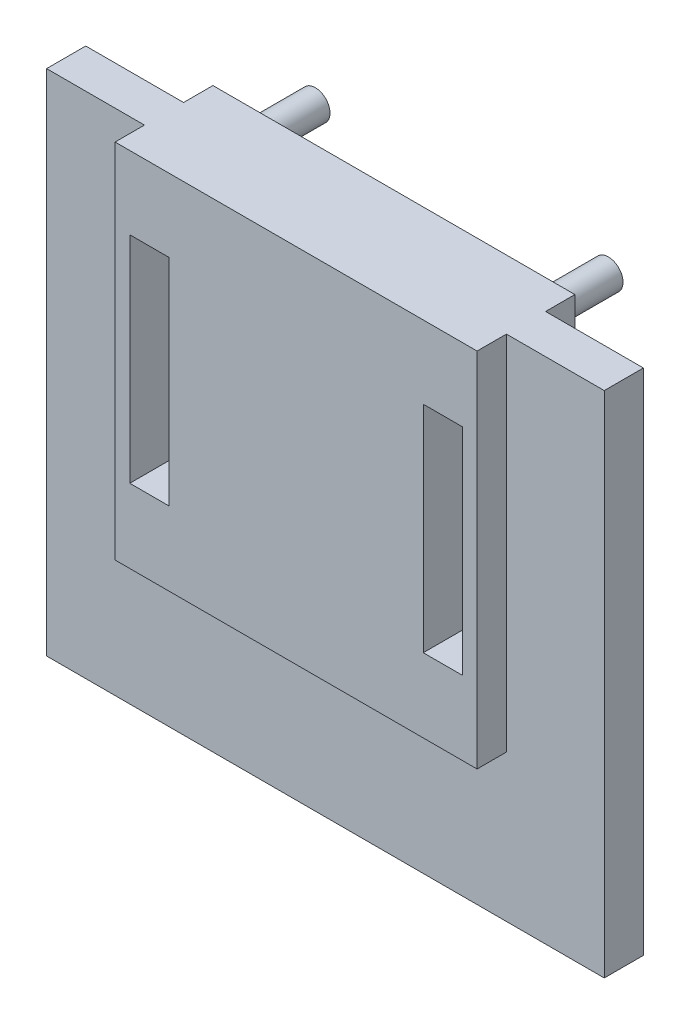
ISO-10303-21;
HEADER;
FILE_DESCRIPTION(('STEP AP214'),'2;1');
FILE_NAME('part.step','',(''),(''),'','','');
FILE_SCHEMA(('AUTOMOTIVE_DESIGN { 1 0 10303 214 1 1 1 1 }'));
ENDSEC;
DATA;
#1=APPLICATION_CONTEXT('core data for automotive mechanical design processes');
#2=APPLICATION_PROTOCOL_DEFINITION('international standard','automotive_design',2000,#1);
#3=PRODUCT_CONTEXT('',#1,'mechanical');
#4=PRODUCT('Part','Part','',(#3));
#5=PRODUCT_RELATED_PRODUCT_CATEGORY('part','',(#4));
#6=PRODUCT_DEFINITION_FORMATION('','',#4);
#7=PRODUCT_DEFINITION_CONTEXT('part definition',#1,'design');
#8=PRODUCT_DEFINITION('design','',#6,#7);
#9=PRODUCT_DEFINITION_SHAPE('','',#8);
#10=(LENGTH_UNIT() NAMED_UNIT(*) SI_UNIT(.MILLI.,.METRE.));
#11=(NAMED_UNIT(*) PLANE_ANGLE_UNIT() SI_UNIT($,.RADIAN.));
#12=(NAMED_UNIT(*) SI_UNIT($,.STERADIAN.) SOLID_ANGLE_UNIT());
#13=UNCERTAINTY_MEASURE_WITH_UNIT(LENGTH_MEASURE(1.E-05),#10,'distance_accuracy_value','');
#14=(GEOMETRIC_REPRESENTATION_CONTEXT(3) GLOBAL_UNCERTAINTY_ASSIGNED_CONTEXT((#13)) GLOBAL_UNIT_ASSIGNED_CONTEXT((#10,
#11,#12)) REPRESENTATION_CONTEXT('',''));
#15=CARTESIAN_POINT('',(0.,0.,0.));
#16=DIRECTION('',(0.,0.,1.));
#17=DIRECTION('',(1.,0.,0.));
#18=AXIS2_PLACEMENT_3D('',#15,#16,#17);
#19=CARTESIAN_POINT('',(0.,0.,0.));
#20=DIRECTION('',(0.,0.,1.));
#21=DIRECTION('',(1.,0.,0.));
#22=AXIS2_PLACEMENT_3D('',#19,#20,#21);
#23=PLANE('',#22);
#24=DIRECTION('',(0.,-1.,0.));
#25=VECTOR('',#24,1.);
#26=CARTESIAN_POINT('',(18.5,26.,0.));
#27=LINE('',#26,#25);
#28=CARTESIAN_POINT('',(18.5,26.,0.));
#29=VERTEX_POINT('',#28);
#30=CARTESIAN_POINT('',(18.5,-11.,0.));
#31=VERTEX_POINT('',#30);
#32=EDGE_CURVE('E256',#29,#31,#27,.T.);
#33=ORIENTED_EDGE('',*,*,#32,.F.);
#34=DIRECTION('',(-1.,0.,0.));
#35=VECTOR('',#34,1.);
#36=CARTESIAN_POINT('',(28.5,26.,0.));
#37=LINE('',#36,#35);
#38=CARTESIAN_POINT('',(28.5,26.,0.));
#39=VERTEX_POINT('',#38);
#40=EDGE_CURVE('E320',#39,#29,#37,.T.);
#41=ORIENTED_EDGE('',*,*,#40,.F.);
#42=DIRECTION('',(0.,1.,0.));
#43=VECTOR('',#42,1.);
#44=CARTESIAN_POINT('',(28.5,-26.,0.));
#45=LINE('',#44,#43);
#46=CARTESIAN_POINT('',(28.5,-26.,0.));
#47=VERTEX_POINT('',#46);
#48=EDGE_CURVE('E333',#47,#39,#45,.T.);
#49=ORIENTED_EDGE('',*,*,#48,.F.);
#50=DIRECTION('',(1.,0.,0.));
#51=VECTOR('',#50,1.);
#52=CARTESIAN_POINT('',(28.5,-26.,0.));
#53=LINE('',#52,#51);
#54=CARTESIAN_POINT('',(-28.5,-26.,0.));
#55=VERTEX_POINT('',#54);
#56=EDGE_CURVE('E331',#55,#47,#53,.T.);
#57=ORIENTED_EDGE('',*,*,#56,.F.);
#58=DIRECTION('',(0.,-1.,0.));
#59=VECTOR('',#58,1.);
#60=CARTESIAN_POINT('',(-28.5,-26.,0.));
#61=LINE('',#60,#59);
#62=CARTESIAN_POINT('',(-28.5,26.,0.));
#63=VERTEX_POINT('',#62);
#64=EDGE_CURVE('E315',#63,#55,#61,.T.);
#65=ORIENTED_EDGE('',*,*,#64,.F.);
#66=CARTESIAN_POINT('',(-18.5,26.,0.));
#67=VERTEX_POINT('',#66);
#68=EDGE_CURVE('E335',#67,#63,#37,.T.);
#69=ORIENTED_EDGE('',*,*,#68,.F.);
#70=DIRECTION('',(0.,1.,0.));
#71=VECTOR('',#70,1.);
#72=CARTESIAN_POINT('',(-18.5,26.,0.));
#73=LINE('',#72,#71);
#74=CARTESIAN_POINT('',(-18.5,-11.,0.));
#75=VERTEX_POINT('',#74);
#76=EDGE_CURVE('E263',#75,#67,#73,.T.);
#77=ORIENTED_EDGE('',*,*,#76,.F.);
#78=DIRECTION('',(-1.,0.,0.));
#79=VECTOR('',#78,1.);
#80=CARTESIAN_POINT('',(18.5,-11.,0.));
#81=LINE('',#80,#79);
#82=EDGE_CURVE('E272',#31,#75,#81,.T.);
#83=ORIENTED_EDGE('',*,*,#82,.F.);
#84=EDGE_LOOP('',(#33,#41,#49,#57,#65,#69,#77,#83));
#85=FACE_BOUND('',#84,.T.);
#86=ADVANCED_FACE('F39',(#85),#23,.F.);
#87=CARTESIAN_POINT('',(-28.5,-26.,4.));
#88=DIRECTION('',(1.,0.,0.));
#89=DIRECTION('',(0.,0.,-1.));
#90=AXIS2_PLACEMENT_3D('',#87,#88,#89);
#91=PLANE('',#90);
#92=ORIENTED_EDGE('',*,*,#64,.T.);
#93=DIRECTION('',(0.,0.,-1.));
#94=VECTOR('',#93,1.);
#95=CARTESIAN_POINT('',(-28.5,-26.,4.));
#96=LINE('',#95,#94);
#97=CARTESIAN_POINT('',(-28.5,-26.,4.));
#98=VERTEX_POINT('',#97);
#99=EDGE_CURVE('E346',#98,#55,#96,.T.);
#100=ORIENTED_EDGE('',*,*,#99,.F.);
#101=DIRECTION('',(0.,-1.,0.));
#102=VECTOR('',#101,1.);
#103=CARTESIAN_POINT('',(-28.5,-26.,4.));
#104=LINE('',#103,#102);
#105=CARTESIAN_POINT('',(-28.5,26.,4.));
#106=VERTEX_POINT('',#105);
#107=EDGE_CURVE('E316',#106,#98,#104,.T.);
#108=ORIENTED_EDGE('',*,*,#107,.F.);
#109=DIRECTION('',(0.,0.,-1.));
#110=VECTOR('',#109,1.);
#111=CARTESIAN_POINT('',(-28.5,26.,4.));
#112=LINE('',#111,#110);
#113=EDGE_CURVE('E328',#106,#63,#112,.T.);
#114=ORIENTED_EDGE('',*,*,#113,.T.);
#115=EDGE_LOOP('',(#92,#100,#108,#114));
#116=FACE_BOUND('',#115,.T.);
#117=ADVANCED_FACE('F41',(#116),#91,.F.);
#118=CARTESIAN_POINT('',(28.5,-26.,4.));
#119=DIRECTION('',(0.,1.,0.));
#120=DIRECTION('',(-1.,0.,0.));
#121=AXIS2_PLACEMENT_3D('',#118,#119,#120);
#122=PLANE('',#121);
#123=ORIENTED_EDGE('',*,*,#56,.T.);
#124=DIRECTION('',(0.,0.,-1.));
#125=VECTOR('',#124,1.);
#126=CARTESIAN_POINT('',(28.5,-26.,4.));
#127=LINE('',#126,#125);
#128=CARTESIAN_POINT('',(28.5,-26.,4.));
#129=VERTEX_POINT('',#128);
#130=EDGE_CURVE('E343',#129,#47,#127,.T.);
#131=ORIENTED_EDGE('',*,*,#130,.F.);
#132=DIRECTION('',(1.,0.,0.));
#133=VECTOR('',#132,1.);
#134=CARTESIAN_POINT('',(28.5,-26.,4.));
#135=LINE('',#134,#133);
#136=EDGE_CURVE('E319',#98,#129,#135,.T.);
#137=ORIENTED_EDGE('',*,*,#136,.F.);
#138=ORIENTED_EDGE('',*,*,#99,.T.);
#139=EDGE_LOOP('',(#123,#131,#137,#138));
#140=FACE_BOUND('',#139,.T.);
#141=ADVANCED_FACE('F417',(#140),#122,.F.);
#142=CARTESIAN_POINT('',(28.5,-26.,4.));
#143=DIRECTION('',(-1.,0.,0.));
#144=DIRECTION('',(0.,0.,1.));
#145=AXIS2_PLACEMENT_3D('',#142,#143,#144);
#146=PLANE('',#145);
#147=ORIENTED_EDGE('',*,*,#48,.T.);
#148=DIRECTION('',(0.,0.,-1.));
#149=VECTOR('',#148,1.);
#150=CARTESIAN_POINT('',(28.5,26.,4.));
#151=LINE('',#150,#149);
#152=CARTESIAN_POINT('',(28.5,26.,4.));
#153=VERTEX_POINT('',#152);
#154=EDGE_CURVE('E340',#153,#39,#151,.T.);
#155=ORIENTED_EDGE('',*,*,#154,.F.);
#156=DIRECTION('',(0.,1.,0.));
#157=VECTOR('',#156,1.);
#158=CARTESIAN_POINT('',(28.5,-26.,4.));
#159=LINE('',#158,#157);
#160=EDGE_CURVE('E322',#129,#153,#159,.T.);
#161=ORIENTED_EDGE('',*,*,#160,.F.);
#162=ORIENTED_EDGE('',*,*,#130,.T.);
#163=EDGE_LOOP('',(#147,#155,#161,#162));
#164=FACE_BOUND('',#163,.T.);
#165=ADVANCED_FACE('F415',(#164),#146,.F.);
#166=CARTESIAN_POINT('',(28.5,26.,4.));
#167=DIRECTION('',(0.,-1.,0.));
#168=DIRECTION('',(1.,0.,0.));
#169=AXIS2_PLACEMENT_3D('',#166,#167,#168);
#170=PLANE('',#169);
#171=ORIENTED_EDGE('',*,*,#40,.T.);
#172=DIRECTION('',(0.,0.,1.));
#173=VECTOR('',#172,1.);
#174=CARTESIAN_POINT('',(18.5,26.,-2.99999999999999));
#175=LINE('',#174,#173);
#176=CARTESIAN_POINT('',(18.5,26.,-2.99999999999999));
#177=VERTEX_POINT('',#176);
#178=EDGE_CURVE('E269',#177,#29,#175,.T.);
#179=ORIENTED_EDGE('',*,*,#178,.F.);
#180=DIRECTION('',(1.,0.,0.));
#181=VECTOR('',#180,1.);
#182=CARTESIAN_POINT('',(18.5,26.,-2.99999999999999));
#183=LINE('',#182,#181);
#184=CARTESIAN_POINT('',(-18.5,26.,-2.99999999999999));
#185=VERTEX_POINT('',#184);
#186=EDGE_CURVE('E267',#185,#177,#183,.T.);
#187=ORIENTED_EDGE('',*,*,#186,.F.);
#188=DIRECTION('',(0.,0.,1.));
#189=VECTOR('',#188,1.);
#190=CARTESIAN_POINT('',(-18.5,26.,-2.99999999999999));
#191=LINE('',#190,#189);
#192=EDGE_CURVE('E279',#185,#67,#191,.T.);
#193=ORIENTED_EDGE('',*,*,#192,.T.);
#194=ORIENTED_EDGE('',*,*,#68,.T.);
#195=ORIENTED_EDGE('',*,*,#113,.F.);
#196=DIRECTION('',(-1.,0.,0.));
#197=VECTOR('',#196,1.);
#198=CARTESIAN_POINT('',(28.5,26.,4.));
#199=LINE('',#198,#197);
#200=CARTESIAN_POINT('',(-18.5,26.,4.));
#201=VERTEX_POINT('',#200);
#202=EDGE_CURVE('E324',#201,#106,#199,.T.);
#203=ORIENTED_EDGE('',*,*,#202,.F.);
#204=DIRECTION('',(0.,0.,-1.));
#205=VECTOR('',#204,1.);
#206=CARTESIAN_POINT('',(-18.5,26.,6.99999999999999));
#207=LINE('',#206,#205);
#208=CARTESIAN_POINT('',(-18.5,26.,6.99999999999999));
#209=VERTEX_POINT('',#208);
#210=EDGE_CURVE('E308',#209,#201,#207,.T.);
#211=ORIENTED_EDGE('',*,*,#210,.F.);
#212=DIRECTION('',(1.,0.,0.));
#213=VECTOR('',#212,1.);
#214=CARTESIAN_POINT('',(-18.5,26.,6.99999999999999));
#215=LINE('',#214,#213);
#216=CARTESIAN_POINT('',(18.5,26.,6.99999999999999));
#217=VERTEX_POINT('',#216);
#218=EDGE_CURVE('E295',#209,#217,#215,.T.);
#219=ORIENTED_EDGE('',*,*,#218,.T.);
#220=DIRECTION('',(0.,0.,-1.));
#221=VECTOR('',#220,1.);
#222=CARTESIAN_POINT('',(18.5,26.,6.99999999999999));
#223=LINE('',#222,#221);
#224=CARTESIAN_POINT('',(18.5,26.,4.));
#225=VERTEX_POINT('',#224);
#226=EDGE_CURVE('E310',#217,#225,#223,.T.);
#227=ORIENTED_EDGE('',*,*,#226,.T.);
#228=EDGE_CURVE('E325',#153,#225,#199,.T.);
#229=ORIENTED_EDGE('',*,*,#228,.F.);
#230=ORIENTED_EDGE('',*,*,#154,.T.);
#231=EDGE_LOOP('',(#171,#179,#187,#193,#194,#195,#203,#211,#219,#227,#229,#230));
#232=FACE_BOUND('',#231,.T.);
#233=ADVANCED_FACE('F384',(#232),#170,.F.);
#234=CARTESIAN_POINT('',(0.,0.,4.));
#235=DIRECTION('',(0.,0.,1.));
#236=DIRECTION('',(1.,0.,0.));
#237=AXIS2_PLACEMENT_3D('',#234,#235,#236);
#238=PLANE('',#237);
#239=DIRECTION('',(0.,-1.,0.));
#240=VECTOR('',#239,1.);
#241=CARTESIAN_POINT('',(-18.5,26.,4.));
#242=LINE('',#241,#240);
#243=CARTESIAN_POINT('',(-18.5,-11.,4.));
#244=VERTEX_POINT('',#243);
#245=EDGE_CURVE('E292',#201,#244,#242,.T.);
#246=ORIENTED_EDGE('',*,*,#245,.F.);
#247=ORIENTED_EDGE('',*,*,#202,.T.);
#248=ORIENTED_EDGE('',*,*,#107,.T.);
#249=ORIENTED_EDGE('',*,*,#136,.T.);
#250=ORIENTED_EDGE('',*,*,#160,.T.);
#251=ORIENTED_EDGE('',*,*,#228,.T.);
#252=DIRECTION('',(0.,-1.,0.));
#253=VECTOR('',#252,1.);
#254=CARTESIAN_POINT('',(18.5,26.,4.));
#255=LINE('',#254,#253);
#256=CARTESIAN_POINT('',(18.5,-11.,4.));
#257=VERTEX_POINT('',#256);
#258=EDGE_CURVE('E302',#225,#257,#255,.T.);
#259=ORIENTED_EDGE('',*,*,#258,.T.);
#260=DIRECTION('',(1.,0.,0.));
#261=VECTOR('',#260,1.);
#262=CARTESIAN_POINT('',(-18.5,-11.,4.));
#263=LINE('',#262,#261);
#264=EDGE_CURVE('E288',#244,#257,#263,.T.);
#265=ORIENTED_EDGE('',*,*,#264,.F.);
#266=EDGE_LOOP('',(#246,#247,#248,#249,#250,#251,#259,#265));
#267=FACE_BOUND('',#266,.T.);
#268=ADVANCED_FACE('F398',(#267),#238,.T.);
#269=CARTESIAN_POINT('',(-18.5,-11.,6.99999999999999));
#270=DIRECTION('',(0.,1.,0.));
#271=DIRECTION('',(0.,0.,1.));
#272=AXIS2_PLACEMENT_3D('',#269,#270,#271);
#273=PLANE('',#272);
#274=ORIENTED_EDGE('',*,*,#264,.T.);
#275=DIRECTION('',(0.,0.,-1.));
#276=VECTOR('',#275,1.);
#277=CARTESIAN_POINT('',(18.5,-11.,6.99999999999999));
#278=LINE('',#277,#276);
#279=CARTESIAN_POINT('',(18.5,-11.,6.99999999999999));
#280=VERTEX_POINT('',#279);
#281=EDGE_CURVE('E312',#280,#257,#278,.T.);
#282=ORIENTED_EDGE('',*,*,#281,.F.);
#283=DIRECTION('',(1.,0.,0.));
#284=VECTOR('',#283,1.);
#285=CARTESIAN_POINT('',(-18.5,-11.,6.99999999999999));
#286=LINE('',#285,#284);
#287=CARTESIAN_POINT('',(-18.5,-11.,6.99999999999999));
#288=VERTEX_POINT('',#287);
#289=EDGE_CURVE('E289',#288,#280,#286,.T.);
#290=ORIENTED_EDGE('',*,*,#289,.F.);
#291=DIRECTION('',(0.,0.,-1.));
#292=VECTOR('',#291,1.);
#293=CARTESIAN_POINT('',(-18.5,-11.,6.99999999999999));
#294=LINE('',#293,#292);
#295=EDGE_CURVE('E300',#288,#244,#294,.T.);
#296=ORIENTED_EDGE('',*,*,#295,.T.);
#297=EDGE_LOOP('',(#274,#282,#290,#296));
#298=FACE_BOUND('',#297,.T.);
#299=ADVANCED_FACE('F437',(#298),#273,.F.);
#300=CARTESIAN_POINT('',(18.5,26.,6.99999999999999));
#301=DIRECTION('',(1.,0.,0.));
#302=DIRECTION('',(0.,1.,0.));
#303=AXIS2_PLACEMENT_3D('',#300,#301,#302);
#304=PLANE('',#303);
#305=ORIENTED_EDGE('',*,*,#258,.F.);
#306=ORIENTED_EDGE('',*,*,#226,.F.);
#307=DIRECTION('',(0.,-1.,0.));
#308=VECTOR('',#307,1.);
#309=CARTESIAN_POINT('',(18.5,26.,6.99999999999999));
#310=LINE('',#309,#308);
#311=EDGE_CURVE('E291',#217,#280,#310,.T.);
#312=ORIENTED_EDGE('',*,*,#311,.T.);
#313=ORIENTED_EDGE('',*,*,#281,.T.);
#314=EDGE_LOOP('',(#305,#306,#312,#313));
#315=FACE_BOUND('',#314,.T.);
#316=ADVANCED_FACE('F412',(#315),#304,.T.);
#317=CARTESIAN_POINT('',(-18.5,26.,6.99999999999999));
#318=DIRECTION('',(1.,0.,0.));
#319=DIRECTION('',(0.,1.,0.));
#320=AXIS2_PLACEMENT_3D('',#317,#318,#319);
#321=PLANE('',#320);
#322=ORIENTED_EDGE('',*,*,#245,.T.);
#323=ORIENTED_EDGE('',*,*,#295,.F.);
#324=DIRECTION('',(0.,-1.,0.));
#325=VECTOR('',#324,1.);
#326=CARTESIAN_POINT('',(-18.5,26.,6.99999999999999));
#327=LINE('',#326,#325);
#328=EDGE_CURVE('E298',#209,#288,#327,.T.);
#329=ORIENTED_EDGE('',*,*,#328,.F.);
#330=ORIENTED_EDGE('',*,*,#210,.T.);
#331=EDGE_LOOP('',(#322,#323,#329,#330));
#332=FACE_BOUND('',#331,.T.);
#333=ADVANCED_FACE('F405',(#332),#321,.F.);
#334=CARTESIAN_POINT('',(0.,0.,6.99999999999999));
#335=DIRECTION('',(0.,0.,-1.));
#336=DIRECTION('',(-1.,0.,0.));
#337=AXIS2_PLACEMENT_3D('',#334,#335,#336);
#338=PLANE('',#337);
#339=DIRECTION('',(1.,0.,0.));
#340=VECTOR('',#339,1.);
#341=CARTESIAN_POINT('',(17.,18.5432109136902,6.99999999999999));
#342=LINE('',#341,#340);
#343=CARTESIAN_POINT('',(13.,18.5432109136902,6.99999999999999));
#344=VERTEX_POINT('',#343);
#345=CARTESIAN_POINT('',(17.,18.5432109136902,6.99999999999999));
#346=VERTEX_POINT('',#345);
#347=EDGE_CURVE('E188',#344,#346,#342,.T.);
#348=ORIENTED_EDGE('',*,*,#347,.T.);
#349=DIRECTION('',(0.,-1.,0.));
#350=VECTOR('',#349,1.);
#351=CARTESIAN_POINT('',(17.,18.5432109136902,6.99999999999999));
#352=LINE('',#351,#350);
#353=CARTESIAN_POINT('',(17.,-3.45678908630983,6.99999999999999));
#354=VERTEX_POINT('',#353);
#355=EDGE_CURVE('E180',#346,#354,#352,.T.);
#356=ORIENTED_EDGE('',*,*,#355,.T.);
#357=DIRECTION('',(-1.,0.,0.));
#358=VECTOR('',#357,1.);
#359=CARTESIAN_POINT('',(17.,-3.45678908630983,6.99999999999999));
#360=LINE('',#359,#358);
#361=CARTESIAN_POINT('',(13.,-3.45678908630983,6.99999999999999));
#362=VERTEX_POINT('',#361);
#363=EDGE_CURVE('E191',#354,#362,#360,.T.);
#364=ORIENTED_EDGE('',*,*,#363,.T.);
#365=DIRECTION('',(0.,1.,0.));
#366=VECTOR('',#365,1.);
#367=CARTESIAN_POINT('',(13.,18.5432109136902,6.99999999999999));
#368=LINE('',#367,#366);
#369=EDGE_CURVE('E54',#362,#344,#368,.T.);
#370=ORIENTED_EDGE('',*,*,#369,.T.);
#371=EDGE_LOOP('',(#348,#356,#364,#370));
#372=FACE_BOUND('',#371,.T.);
#373=DIRECTION('',(1.,0.,0.));
#374=VECTOR('',#373,1.);
#375=CARTESIAN_POINT('',(-13.,18.5432109136902,6.99999999999999));
#376=LINE('',#375,#374);
#377=CARTESIAN_POINT('',(-17.,18.5432109136902,6.99999999999999));
#378=VERTEX_POINT('',#377);
#379=CARTESIAN_POINT('',(-13.,18.5432109136902,6.99999999999999));
#380=VERTEX_POINT('',#379);
#381=EDGE_CURVE('E221',#378,#380,#376,.T.);
#382=ORIENTED_EDGE('',*,*,#381,.T.);
#383=DIRECTION('',(0.,-1.,0.));
#384=VECTOR('',#383,1.);
#385=CARTESIAN_POINT('',(-13.,18.5432109136902,6.99999999999999));
#386=LINE('',#385,#384);
#387=CARTESIAN_POINT('',(-13.,-3.45678908630983,6.99999999999999));
#388=VERTEX_POINT('',#387);
#389=EDGE_CURVE('E232',#380,#388,#386,.T.);
#390=ORIENTED_EDGE('',*,*,#389,.T.);
#391=DIRECTION('',(-1.,0.,0.));
#392=VECTOR('',#391,1.);
#393=CARTESIAN_POINT('',(-13.,-3.45678908630983,6.99999999999999));
#394=LINE('',#393,#392);
#395=CARTESIAN_POINT('',(-17.,-3.45678908630983,6.99999999999999));
#396=VERTEX_POINT('',#395);
#397=EDGE_CURVE('E242',#388,#396,#394,.T.);
#398=ORIENTED_EDGE('',*,*,#397,.T.);
#399=DIRECTION('',(0.,1.,0.));
#400=VECTOR('',#399,1.);
#401=CARTESIAN_POINT('',(-17.,18.5432109136902,6.99999999999999));
#402=LINE('',#401,#400);
#403=EDGE_CURVE('E62',#396,#378,#402,.T.);
#404=ORIENTED_EDGE('',*,*,#403,.T.);
#405=EDGE_LOOP('',(#382,#390,#398,#404));
#406=FACE_BOUND('',#405,.T.);
#407=ORIENTED_EDGE('',*,*,#289,.T.);
#408=ORIENTED_EDGE('',*,*,#311,.F.);
#409=ORIENTED_EDGE('',*,*,#218,.F.);
#410=ORIENTED_EDGE('',*,*,#328,.T.);
#411=EDGE_LOOP('',(#407,#408,#409,#410));
#412=FACE_BOUND('',#411,.T.);
#413=ADVANCED_FACE('F195',(#372,#406,#412),#338,.F.);
#414=CARTESIAN_POINT('',(18.5,26.,-2.99999999999999));
#415=DIRECTION('',(-1.,0.,0.));
#416=DIRECTION('',(0.,-1.,0.));
#417=AXIS2_PLACEMENT_3D('',#414,#415,#416);
#418=PLANE('',#417);
#419=ORIENTED_EDGE('',*,*,#32,.T.);
#420=DIRECTION('',(0.,0.,1.));
#421=VECTOR('',#420,1.);
#422=CARTESIAN_POINT('',(18.5,-11.,-2.99999999999999));
#423=LINE('',#422,#421);
#424=CARTESIAN_POINT('',(18.5,-11.,-2.99999999999999));
#425=VERTEX_POINT('',#424);
#426=EDGE_CURVE('E285',#425,#31,#423,.T.);
#427=ORIENTED_EDGE('',*,*,#426,.F.);
#428=DIRECTION('',(0.,-1.,0.));
#429=VECTOR('',#428,1.);
#430=CARTESIAN_POINT('',(18.5,26.,-2.99999999999999));
#431=LINE('',#430,#429);
#432=EDGE_CURVE('E259',#177,#425,#431,.T.);
#433=ORIENTED_EDGE('',*,*,#432,.F.);
#434=ORIENTED_EDGE('',*,*,#178,.T.);
#435=EDGE_LOOP('',(#419,#427,#433,#434));
#436=FACE_BOUND('',#435,.T.);
#437=ADVANCED_FACE('F377',(#436),#418,.F.);
#438=CARTESIAN_POINT('',(18.5,-11.,-2.99999999999999));
#439=DIRECTION('',(0.,1.,0.));
#440=DIRECTION('',(0.,0.,1.));
#441=AXIS2_PLACEMENT_3D('',#438,#439,#440);
#442=PLANE('',#441);
#443=ORIENTED_EDGE('',*,*,#82,.T.);
#444=DIRECTION('',(0.,0.,1.));
#445=VECTOR('',#444,1.);
#446=CARTESIAN_POINT('',(-18.5,-11.,-2.99999999999999));
#447=LINE('',#446,#445);
#448=CARTESIAN_POINT('',(-18.5,-11.,-2.99999999999999));
#449=VERTEX_POINT('',#448);
#450=EDGE_CURVE('E282',#449,#75,#447,.T.);
#451=ORIENTED_EDGE('',*,*,#450,.F.);
#452=DIRECTION('',(-1.,0.,0.));
#453=VECTOR('',#452,1.);
#454=CARTESIAN_POINT('',(18.5,-11.,-2.99999999999999));
#455=LINE('',#454,#453);
#456=EDGE_CURVE('E262',#425,#449,#455,.T.);
#457=ORIENTED_EDGE('',*,*,#456,.F.);
#458=ORIENTED_EDGE('',*,*,#426,.T.);
#459=EDGE_LOOP('',(#443,#451,#457,#458));
#460=FACE_BOUND('',#459,.T.);
#461=ADVANCED_FACE('F379',(#460),#442,.F.);
#462=CARTESIAN_POINT('',(-18.5,26.,-2.99999999999999));
#463=DIRECTION('',(1.,0.,0.));
#464=DIRECTION('',(0.,0.,-1.));
#465=AXIS2_PLACEMENT_3D('',#462,#463,#464);
#466=PLANE('',#465);
#467=ORIENTED_EDGE('',*,*,#76,.T.);
#468=ORIENTED_EDGE('',*,*,#192,.F.);
#469=DIRECTION('',(0.,1.,0.));
#470=VECTOR('',#469,1.);
#471=CARTESIAN_POINT('',(-18.5,26.,-2.99999999999999));
#472=LINE('',#471,#470);
#473=EDGE_CURVE('E265',#449,#185,#472,.T.);
#474=ORIENTED_EDGE('',*,*,#473,.F.);
#475=ORIENTED_EDGE('',*,*,#450,.T.);
#476=EDGE_LOOP('',(#467,#468,#474,#475));
#477=FACE_BOUND('',#476,.T.);
#478=ADVANCED_FACE('F364',(#477),#466,.F.);
#479=CARTESIAN_POINT('',(0.,0.,-2.99999999999999));
#480=DIRECTION('',(0.,0.,-1.));
#481=DIRECTION('',(-1.,0.,0.));
#482=AXIS2_PLACEMENT_3D('',#479,#480,#481);
#483=PLANE('',#482);
#484=DIRECTION('',(0.,-1.,0.));
#485=VECTOR('',#484,1.);
#486=CARTESIAN_POINT('',(17.,18.5432109136902,-2.99999999999999));
#487=LINE('',#486,#485);
#488=CARTESIAN_POINT('',(17.,18.5432109136902,-2.99999999999999));
#489=VERTEX_POINT('',#488);
#490=CARTESIAN_POINT('',(17.,-3.45678908630983,-2.99999999999999));
#491=VERTEX_POINT('',#490);
#492=EDGE_CURVE('E183',#489,#491,#487,.T.);
#493=ORIENTED_EDGE('',*,*,#492,.F.);
#494=DIRECTION('',(1.,0.,0.));
#495=VECTOR('',#494,1.);
#496=CARTESIAN_POINT('',(17.,18.5432109136902,-2.99999999999999));
#497=LINE('',#496,#495);
#498=CARTESIAN_POINT('',(13.,18.5432109136902,-2.99999999999999));
#499=VERTEX_POINT('',#498);
#500=EDGE_CURVE('E198',#499,#489,#497,.T.);
#501=ORIENTED_EDGE('',*,*,#500,.F.);
#502=DIRECTION('',(0.,1.,0.));
#503=VECTOR('',#502,1.);
#504=CARTESIAN_POINT('',(13.,18.5432109136902,-2.99999999999999));
#505=LINE('',#504,#503);
#506=CARTESIAN_POINT('',(13.,-3.45678908630983,-2.99999999999999));
#507=VERTEX_POINT('',#506);
#508=EDGE_CURVE('E201',#507,#499,#505,.T.);
#509=ORIENTED_EDGE('',*,*,#508,.F.);
#510=DIRECTION('',(-1.,0.,0.));
#511=VECTOR('',#510,1.);
#512=CARTESIAN_POINT('',(17.,-3.45678908630983,-2.99999999999999));
#513=LINE('',#512,#511);
#514=EDGE_CURVE('E207',#491,#507,#513,.T.);
#515=ORIENTED_EDGE('',*,*,#514,.F.);
#516=EDGE_LOOP('',(#493,#501,#509,#515));
#517=FACE_BOUND('',#516,.T.);
#518=DIRECTION('',(0.,-1.,0.));
#519=VECTOR('',#518,1.);
#520=CARTESIAN_POINT('',(-13.,18.5432109136902,-2.99999999999999));
#521=LINE('',#520,#519);
#522=CARTESIAN_POINT('',(-13.,18.5432109136902,-2.99999999999999));
#523=VERTEX_POINT('',#522);
#524=CARTESIAN_POINT('',(-13.,-3.45678908630983,-2.99999999999999));
#525=VERTEX_POINT('',#524);
#526=EDGE_CURVE('E208',#523,#525,#521,.T.);
#527=ORIENTED_EDGE('',*,*,#526,.F.);
#528=DIRECTION('',(1.,0.,0.));
#529=VECTOR('',#528,1.);
#530=CARTESIAN_POINT('',(-13.,18.5432109136902,-2.99999999999999));
#531=LINE('',#530,#529);
#532=CARTESIAN_POINT('',(-17.,18.5432109136902,-2.99999999999999));
#533=VERTEX_POINT('',#532);
#534=EDGE_CURVE('E228',#533,#523,#531,.T.);
#535=ORIENTED_EDGE('',*,*,#534,.F.);
#536=DIRECTION('',(0.,1.,0.));
#537=VECTOR('',#536,1.);
#538=CARTESIAN_POINT('',(-17.,18.5432109136902,-2.99999999999999));
#539=LINE('',#538,#537);
#540=CARTESIAN_POINT('',(-17.,-3.45678908630983,-2.99999999999999));
#541=VERTEX_POINT('',#540);
#542=EDGE_CURVE('E231',#541,#533,#539,.T.);
#543=ORIENTED_EDGE('',*,*,#542,.F.);
#544=DIRECTION('',(-1.,0.,0.));
#545=VECTOR('',#544,1.);
#546=CARTESIAN_POINT('',(-13.,-3.45678908630983,-2.99999999999999));
#547=LINE('',#546,#545);
#548=EDGE_CURVE('E235',#525,#541,#547,.T.);
#549=ORIENTED_EDGE('',*,*,#548,.F.);
#550=EDGE_LOOP('',(#527,#535,#543,#549));
#551=FACE_BOUND('',#550,.T.);
#552=CARTESIAN_POINT('',(-15.0288072757935,-7.51440363789674,-2.99999999999999));
#553=DIRECTION('',(0.,0.,-1.));
#554=DIRECTION('',(-1.,0.,0.));
#555=AXIS2_PLACEMENT_3D('',#552,#553,#554);
#556=CIRCLE('',#555,1.5);
#557=CARTESIAN_POINT('',(-16.5288072757935,-7.51440363789674,-2.99999999999999));
#558=VERTEX_POINT('',#557);
#559=EDGE_CURVE('E11',#558,#558,#556,.T.);
#560=ORIENTED_EDGE('',*,*,#559,.F.);
#561=EDGE_LOOP('',(#560));
#562=FACE_BOUND('',#561,.T.);
#563=CARTESIAN_POINT('',(-15.0288072757935,22.5432109136902,-2.99999999999999));
#564=DIRECTION('',(0.,0.,-1.));
#565=DIRECTION('',(-1.,0.,0.));
#566=AXIS2_PLACEMENT_3D('',#563,#564,#565);
#567=CIRCLE('',#566,1.5);
#568=CARTESIAN_POINT('',(-16.5288072757935,22.5432109136902,-2.99999999999999));
#569=VERTEX_POINT('',#568);
#570=EDGE_CURVE('E47',#569,#569,#567,.T.);
#571=ORIENTED_EDGE('',*,*,#570,.F.);
#572=EDGE_LOOP('',(#571));
#573=FACE_BOUND('',#572,.T.);
#574=CARTESIAN_POINT('',(14.918301339942,22.5432109136902,-2.99999999999999));
#575=DIRECTION('',(0.,0.,-1.));
#576=DIRECTION('',(-1.,0.,0.));
#577=AXIS2_PLACEMENT_3D('',#574,#575,#576);
#578=CIRCLE('',#577,1.5);
#579=CARTESIAN_POINT('',(13.418301339942,22.5432109136902,-2.99999999999999));
#580=VERTEX_POINT('',#579);
#581=EDGE_CURVE('E352',#580,#580,#578,.T.);
#582=ORIENTED_EDGE('',*,*,#581,.F.);
#583=EDGE_LOOP('',(#582));
#584=FACE_BOUND('',#583,.T.);
#585=CARTESIAN_POINT('',(14.918301339942,-7.51440363789674,-2.99999999999999));
#586=DIRECTION('',(0.,0.,-1.));
#587=DIRECTION('',(-1.,0.,0.));
#588=AXIS2_PLACEMENT_3D('',#585,#586,#587);
#589=CIRCLE('',#588,1.5);
#590=CARTESIAN_POINT('',(13.418301339942,-7.51440363789674,-2.99999999999999));
#591=VERTEX_POINT('',#590);
#592=EDGE_CURVE('E349',#591,#591,#589,.T.);
#593=ORIENTED_EDGE('',*,*,#592,.F.);
#594=EDGE_LOOP('',(#593));
#595=FACE_BOUND('',#594,.T.);
#596=ORIENTED_EDGE('',*,*,#432,.T.);
#597=ORIENTED_EDGE('',*,*,#456,.T.);
#598=ORIENTED_EDGE('',*,*,#473,.T.);
#599=ORIENTED_EDGE('',*,*,#186,.T.);
#600=EDGE_LOOP('',(#596,#597,#598,#599));
#601=FACE_BOUND('',#600,.T.);
#602=ADVANCED_FACE('F360',(#517,#551,#562,#573,#584,#595,#601),#483,.T.);
#603=CARTESIAN_POINT('',(14.918301339942,-7.51440363789674,-10.));
#604=DIRECTION('',(0.,0.,1.));
#605=DIRECTION('',(1.,0.,0.));
#606=AXIS2_PLACEMENT_3D('',#603,#604,#605);
#607=CYLINDRICAL_SURFACE('',#606,1.5);
#608=ORIENTED_EDGE('',*,*,#592,.T.);
#609=EDGE_LOOP('',(#608));
#610=FACE_BOUND('',#609,.T.);
#611=CARTESIAN_POINT('',(14.918301339942,-7.51440363789674,-10.));
#612=DIRECTION('',(0.,0.,1.));
#613=DIRECTION('',(1.,0.,0.));
#614=AXIS2_PLACEMENT_3D('',#611,#612,#613);
#615=CIRCLE('',#614,1.5);
#616=CARTESIAN_POINT('',(16.418301339942,-7.51440363789674,-10.));
#617=VERTEX_POINT('',#616);
#618=EDGE_CURVE('E252',#617,#617,#615,.T.);
#619=ORIENTED_EDGE('',*,*,#618,.T.);
#620=EDGE_LOOP('',(#619));
#621=FACE_BOUND('',#620,.T.);
#622=ADVANCED_FACE('F363',(#610,#621),#607,.T.);
#623=CARTESIAN_POINT('',(14.918301339942,-7.51440363789674,-10.));
#624=DIRECTION('',(0.,0.,1.));
#625=DIRECTION('',(1.,0.,0.));
#626=AXIS2_PLACEMENT_3D('',#623,#624,#625);
#627=PLANE('',#626);
#628=ORIENTED_EDGE('',*,*,#618,.F.);
#629=EDGE_LOOP('',(#628));
#630=FACE_BOUND('',#629,.T.);
#631=ADVANCED_FACE('F455',(#630),#627,.F.);
#632=CARTESIAN_POINT('',(14.918301339942,22.5432109136902,-10.));
#633=DIRECTION('',(0.,0.,1.));
#634=DIRECTION('',(1.,0.,0.));
#635=AXIS2_PLACEMENT_3D('',#632,#633,#634);
#636=CYLINDRICAL_SURFACE('',#635,1.5);
#637=ORIENTED_EDGE('',*,*,#581,.T.);
#638=EDGE_LOOP('',(#637));
#639=FACE_BOUND('',#638,.T.);
#640=CARTESIAN_POINT('',(14.918301339942,22.5432109136902,-10.));
#641=DIRECTION('',(0.,0.,1.));
#642=DIRECTION('',(1.,0.,0.));
#643=AXIS2_PLACEMENT_3D('',#640,#641,#642);
#644=CIRCLE('',#643,1.5);
#645=CARTESIAN_POINT('',(16.418301339942,22.5432109136902,-10.));
#646=VERTEX_POINT('',#645);
#647=EDGE_CURVE('E253',#646,#646,#644,.T.);
#648=ORIENTED_EDGE('',*,*,#647,.T.);
#649=EDGE_LOOP('',(#648));
#650=FACE_BOUND('',#649,.T.);
#651=ADVANCED_FACE('F458',(#639,#650),#636,.T.);
#652=CARTESIAN_POINT('',(14.918301339942,22.5432109136902,-10.));
#653=DIRECTION('',(0.,0.,1.));
#654=DIRECTION('',(1.,0.,0.));
#655=AXIS2_PLACEMENT_3D('',#652,#653,#654);
#656=PLANE('',#655);
#657=ORIENTED_EDGE('',*,*,#647,.F.);
#658=EDGE_LOOP('',(#657));
#659=FACE_BOUND('',#658,.T.);
#660=ADVANCED_FACE('F465',(#659),#656,.F.);
#661=CARTESIAN_POINT('',(-15.0288072757935,22.5432109136902,-10.));
#662=DIRECTION('',(0.,0.,1.));
#663=DIRECTION('',(1.,0.,0.));
#664=AXIS2_PLACEMENT_3D('',#661,#662,#663);
#665=CYLINDRICAL_SURFACE('',#664,1.5);
#666=ORIENTED_EDGE('',*,*,#570,.T.);
#667=EDGE_LOOP('',(#666));
#668=FACE_BOUND('',#667,.T.);
#669=CARTESIAN_POINT('',(-15.0288072757935,22.5432109136902,-10.));
#670=DIRECTION('',(0.,0.,1.));
#671=DIRECTION('',(1.,0.,0.));
#672=AXIS2_PLACEMENT_3D('',#669,#670,#671);
#673=CIRCLE('',#672,1.5);
#674=CARTESIAN_POINT('',(-13.5288072757935,22.5432109136902,-10.));
#675=VERTEX_POINT('',#674);
#676=EDGE_CURVE('E249',#675,#675,#673,.T.);
#677=ORIENTED_EDGE('',*,*,#676,.T.);
#678=EDGE_LOOP('',(#677));
#679=FACE_BOUND('',#678,.T.);
#680=ADVANCED_FACE('F357',(#668,#679),#665,.T.);
#681=CARTESIAN_POINT('',(-15.0288072757935,22.5432109136902,-10.));
#682=DIRECTION('',(0.,0.,1.));
#683=DIRECTION('',(1.,0.,0.));
#684=AXIS2_PLACEMENT_3D('',#681,#682,#683);
#685=PLANE('',#684);
#686=ORIENTED_EDGE('',*,*,#676,.F.);
#687=EDGE_LOOP('',(#686));
#688=FACE_BOUND('',#687,.T.);
#689=ADVANCED_FACE('F472',(#688),#685,.F.);
#690=CARTESIAN_POINT('',(-15.0288072757935,-7.51440363789674,-10.));
#691=DIRECTION('',(0.,0.,1.));
#692=DIRECTION('',(1.,0.,0.));
#693=AXIS2_PLACEMENT_3D('',#690,#691,#692);
#694=CYLINDRICAL_SURFACE('',#693,1.5);
#695=ORIENTED_EDGE('',*,*,#559,.T.);
#696=EDGE_LOOP('',(#695));
#697=FACE_BOUND('',#696,.T.);
#698=CARTESIAN_POINT('',(-15.0288072757935,-7.51440363789674,-10.));
#699=DIRECTION('',(0.,0.,1.));
#700=DIRECTION('',(1.,0.,0.));
#701=AXIS2_PLACEMENT_3D('',#698,#699,#700);
#702=CIRCLE('',#701,1.5);
#703=CARTESIAN_POINT('',(-13.5288072757935,-7.51440363789674,-10.));
#704=VERTEX_POINT('',#703);
#705=EDGE_CURVE('E214',#704,#704,#702,.T.);
#706=ORIENTED_EDGE('',*,*,#705,.T.);
#707=EDGE_LOOP('',(#706));
#708=FACE_BOUND('',#707,.T.);
#709=ADVANCED_FACE('F475',(#697,#708),#694,.T.);
#710=CARTESIAN_POINT('',(-15.0288072757935,-7.51440363789674,-10.));
#711=DIRECTION('',(0.,0.,1.));
#712=DIRECTION('',(1.,0.,0.));
#713=AXIS2_PLACEMENT_3D('',#710,#711,#712);
#714=PLANE('',#713);
#715=ORIENTED_EDGE('',*,*,#705,.F.);
#716=EDGE_LOOP('',(#715));
#717=FACE_BOUND('',#716,.T.);
#718=ADVANCED_FACE('F479',(#717),#714,.F.);
#719=CARTESIAN_POINT('',(-13.,18.5432109136902,6.99999999999999));
#720=DIRECTION('',(1.,0.,0.));
#721=DIRECTION('',(0.,1.,0.));
#722=AXIS2_PLACEMENT_3D('',#719,#720,#721);
#723=PLANE('',#722);
#724=ORIENTED_EDGE('',*,*,#526,.T.);
#725=DIRECTION('',(0.,0.,-1.));
#726=VECTOR('',#725,1.);
#727=CARTESIAN_POINT('',(-13.,-3.45678908630983,6.99999999999999));
#728=LINE('',#727,#726);
#729=EDGE_CURVE('E218',#388,#525,#728,.T.);
#730=ORIENTED_EDGE('',*,*,#729,.F.);
#731=ORIENTED_EDGE('',*,*,#389,.F.);
#732=DIRECTION('',(0.,0.,-1.));
#733=VECTOR('',#732,1.);
#734=CARTESIAN_POINT('',(-13.,18.5432109136902,6.99999999999999));
#735=LINE('',#734,#733);
#736=EDGE_CURVE('E226',#380,#523,#735,.T.);
#737=ORIENTED_EDGE('',*,*,#736,.T.);
#738=EDGE_LOOP('',(#724,#730,#731,#737));
#739=FACE_BOUND('',#738,.T.);
#740=ADVANCED_FACE('F483',(#739),#723,.F.);
#741=CARTESIAN_POINT('',(-13.,18.5432109136902,6.99999999999999));
#742=DIRECTION('',(0.,1.,0.));
#743=DIRECTION('',(-1.,0.,0.));
#744=AXIS2_PLACEMENT_3D('',#741,#742,#743);
#745=PLANE('',#744);
#746=ORIENTED_EDGE('',*,*,#534,.T.);
#747=ORIENTED_EDGE('',*,*,#736,.F.);
#748=ORIENTED_EDGE('',*,*,#381,.F.);
#749=DIRECTION('',(0.,0.,-1.));
#750=VECTOR('',#749,1.);
#751=CARTESIAN_POINT('',(-17.,18.5432109136902,6.99999999999999));
#752=LINE('',#751,#750);
#753=EDGE_CURVE('E224',#378,#533,#752,.T.);
#754=ORIENTED_EDGE('',*,*,#753,.T.);
#755=EDGE_LOOP('',(#746,#747,#748,#754));
#756=FACE_BOUND('',#755,.T.);
#757=ADVANCED_FACE('F485',(#756),#745,.F.);
#758=CARTESIAN_POINT('',(-17.,18.5432109136902,6.99999999999999));
#759=DIRECTION('',(-1.,0.,0.));
#760=DIRECTION('',(0.,-1.,0.));
#761=AXIS2_PLACEMENT_3D('',#758,#759,#760);
#762=PLANE('',#761);
#763=ORIENTED_EDGE('',*,*,#542,.T.);
#764=ORIENTED_EDGE('',*,*,#753,.F.);
#765=ORIENTED_EDGE('',*,*,#403,.F.);
#766=DIRECTION('',(0.,0.,-1.));
#767=VECTOR('',#766,1.);
#768=CARTESIAN_POINT('',(-17.,-3.45678908630983,6.99999999999999));
#769=LINE('',#768,#767);
#770=EDGE_CURVE('E222',#396,#541,#769,.T.);
#771=ORIENTED_EDGE('',*,*,#770,.T.);
#772=EDGE_LOOP('',(#763,#764,#765,#771));
#773=FACE_BOUND('',#772,.T.);
#774=ADVANCED_FACE('F488',(#773),#762,.F.);
#775=CARTESIAN_POINT('',(-13.,-3.45678908630983,6.99999999999999));
#776=DIRECTION('',(0.,-1.,0.));
#777=DIRECTION('',(0.,0.,-1.));
#778=AXIS2_PLACEMENT_3D('',#775,#776,#777);
#779=PLANE('',#778);
#780=ORIENTED_EDGE('',*,*,#548,.T.);
#781=ORIENTED_EDGE('',*,*,#770,.F.);
#782=ORIENTED_EDGE('',*,*,#397,.F.);
#783=ORIENTED_EDGE('',*,*,#729,.T.);
#784=EDGE_LOOP('',(#780,#781,#782,#783));
#785=FACE_BOUND('',#784,.T.);
#786=ADVANCED_FACE('F492',(#785),#779,.F.);
#787=CARTESIAN_POINT('',(17.,18.5432109136902,6.99999999999999));
#788=DIRECTION('',(1.,0.,0.));
#789=DIRECTION('',(0.,1.,0.));
#790=AXIS2_PLACEMENT_3D('',#787,#788,#789);
#791=PLANE('',#790);
#792=ORIENTED_EDGE('',*,*,#492,.T.);
#793=DIRECTION('',(0.,0.,-1.));
#794=VECTOR('',#793,1.);
#795=CARTESIAN_POINT('',(17.,-3.45678908630983,6.99999999999999));
#796=LINE('',#795,#794);
#797=EDGE_CURVE('E176',#354,#491,#796,.T.);
#798=ORIENTED_EDGE('',*,*,#797,.F.);
#799=ORIENTED_EDGE('',*,*,#355,.F.);
#800=DIRECTION('',(0.,0.,-1.));
#801=VECTOR('',#800,1.);
#802=CARTESIAN_POINT('',(17.,18.5432109136902,6.99999999999999));
#803=LINE('',#802,#801);
#804=EDGE_CURVE('E212',#346,#489,#803,.T.);
#805=ORIENTED_EDGE('',*,*,#804,.T.);
#806=EDGE_LOOP('',(#792,#798,#799,#805));
#807=FACE_BOUND('',#806,.T.);
#808=ADVANCED_FACE('F178',(#807),#791,.F.);
#809=CARTESIAN_POINT('',(17.,18.5432109136902,6.99999999999999));
#810=DIRECTION('',(0.,1.,0.));
#811=DIRECTION('',(0.,0.,1.));
#812=AXIS2_PLACEMENT_3D('',#809,#810,#811);
#813=PLANE('',#812);
#814=ORIENTED_EDGE('',*,*,#500,.T.);
#815=ORIENTED_EDGE('',*,*,#804,.F.);
#816=ORIENTED_EDGE('',*,*,#347,.F.);
#817=DIRECTION('',(0.,0.,-1.));
#818=VECTOR('',#817,1.);
#819=CARTESIAN_POINT('',(13.,18.5432109136902,6.99999999999999));
#820=LINE('',#819,#818);
#821=EDGE_CURVE('E215',#344,#499,#820,.T.);
#822=ORIENTED_EDGE('',*,*,#821,.T.);
#823=EDGE_LOOP('',(#814,#815,#816,#822));
#824=FACE_BOUND('',#823,.T.);
#825=ADVANCED_FACE('F501',(#824),#813,.F.);
#826=CARTESIAN_POINT('',(13.,18.5432109136902,6.99999999999999));
#827=DIRECTION('',(-1.,0.,0.));
#828=DIRECTION('',(0.,-1.,0.));
#829=AXIS2_PLACEMENT_3D('',#826,#827,#828);
#830=PLANE('',#829);
#831=ORIENTED_EDGE('',*,*,#508,.T.);
#832=ORIENTED_EDGE('',*,*,#821,.F.);
#833=ORIENTED_EDGE('',*,*,#369,.F.);
#834=DIRECTION('',(0.,0.,-1.));
#835=VECTOR('',#834,1.);
#836=CARTESIAN_POINT('',(13.,-3.45678908630983,6.99999999999999));
#837=LINE('',#836,#835);
#838=EDGE_CURVE('E187',#362,#507,#837,.T.);
#839=ORIENTED_EDGE('',*,*,#838,.T.);
#840=EDGE_LOOP('',(#831,#832,#833,#839));
#841=FACE_BOUND('',#840,.T.);
#842=ADVANCED_FACE('F504',(#841),#830,.F.);
#843=CARTESIAN_POINT('',(17.,-3.45678908630983,6.99999999999999));
#844=DIRECTION('',(0.,-1.,0.));
#845=DIRECTION('',(0.,0.,-1.));
#846=AXIS2_PLACEMENT_3D('',#843,#844,#845);
#847=PLANE('',#846);
#848=ORIENTED_EDGE('',*,*,#514,.T.);
#849=ORIENTED_EDGE('',*,*,#838,.F.);
#850=ORIENTED_EDGE('',*,*,#363,.F.);
#851=ORIENTED_EDGE('',*,*,#797,.T.);
#852=EDGE_LOOP('',(#848,#849,#850,#851));
#853=FACE_BOUND('',#852,.T.);
#854=ADVANCED_FACE('F192',(#853),#847,.F.);
#855=CLOSED_SHELL('',(#86,#117,#141,#165,#233,#268,#299,#316,#333,#413,#437,#461,#478,#602,#622,
#631,#651,#660,#680,#689,#709,#718,#740,#757,#774,#786,#808,#825,#842,#854));
#856=MANIFOLD_SOLID_BREP('B2',#855);
#857=ADVANCED_BREP_SHAPE_REPRESENTATION('',(#18,#856),#14);
#858=SHAPE_DEFINITION_REPRESENTATION(#9,#857);
ENDSEC;
END-ISO-10303-21;
